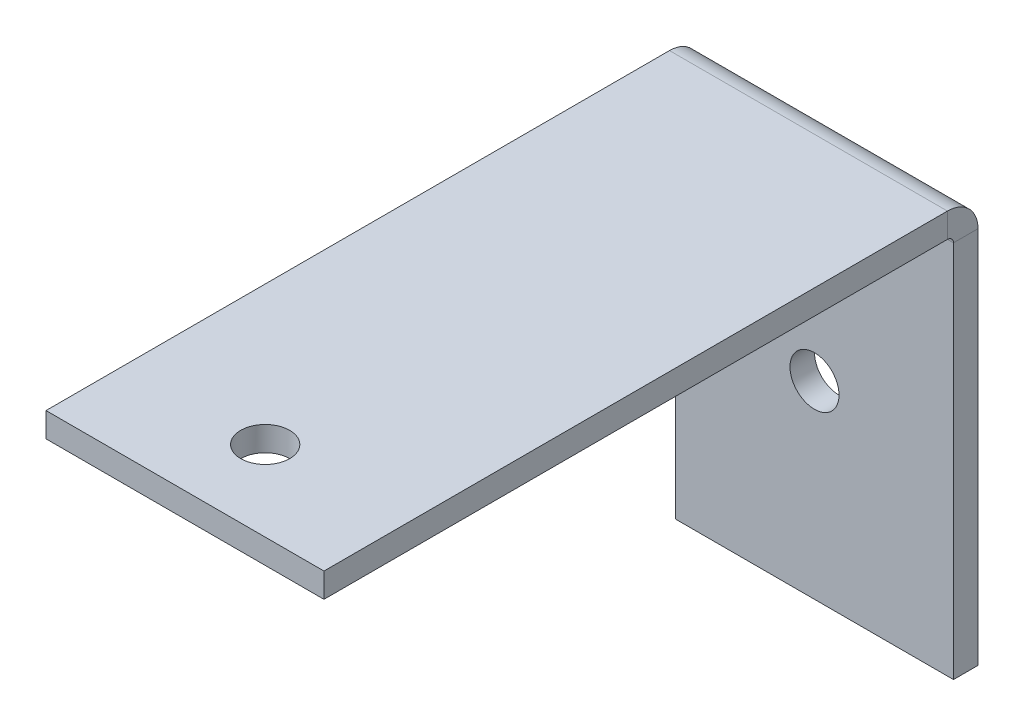
ISO-10303-21;
HEADER;
FILE_DESCRIPTION(('STEP AP214'),'2;1');
FILE_NAME('part.step','',(''),(''),'','','');
FILE_SCHEMA(('AUTOMOTIVE_DESIGN { 1 0 10303 214 1 1 1 1 }'));
ENDSEC;
DATA;
#1=APPLICATION_CONTEXT('core data for automotive mechanical design processes');
#2=APPLICATION_PROTOCOL_DEFINITION('international standard','automotive_design',2000,#1);
#3=PRODUCT_CONTEXT('',#1,'mechanical');
#4=PRODUCT('Part','Part','',(#3));
#5=PRODUCT_RELATED_PRODUCT_CATEGORY('part','',(#4));
#6=PRODUCT_DEFINITION_FORMATION('','',#4);
#7=PRODUCT_DEFINITION_CONTEXT('part definition',#1,'design');
#8=PRODUCT_DEFINITION('design','',#6,#7);
#9=PRODUCT_DEFINITION_SHAPE('','',#8);
#10=(LENGTH_UNIT() NAMED_UNIT(*) SI_UNIT(.MILLI.,.METRE.));
#11=(NAMED_UNIT(*) PLANE_ANGLE_UNIT() SI_UNIT($,.RADIAN.));
#12=(NAMED_UNIT(*) SI_UNIT($,.STERADIAN.) SOLID_ANGLE_UNIT());
#13=UNCERTAINTY_MEASURE_WITH_UNIT(LENGTH_MEASURE(1.E-05),#10,'distance_accuracy_value','');
#14=(GEOMETRIC_REPRESENTATION_CONTEXT(3) GLOBAL_UNCERTAINTY_ASSIGNED_CONTEXT((#13)) GLOBAL_UNIT_ASSIGNED_CONTEXT((#10,
#11,#12)) REPRESENTATION_CONTEXT('',''));
#15=CARTESIAN_POINT('',(0.,0.,0.));
#16=DIRECTION('',(0.,0.,1.));
#17=DIRECTION('',(1.,0.,0.));
#18=AXIS2_PLACEMENT_3D('',#15,#16,#17);
#19=CARTESIAN_POINT('',(0.,50.,3.));
#20=DIRECTION('',(0.,0.,-1.));
#21=DIRECTION('',(-1.,0.,0.));
#22=AXIS2_PLACEMENT_3D('',#19,#20,#21);
#23=PLANE('',#22);
#24=CARTESIAN_POINT('',(17.,23.1317,3.));
#25=DIRECTION('',(0.,0.,1.));
#26=DIRECTION('',(1.,0.,0.));
#27=AXIS2_PLACEMENT_3D('',#24,#25,#26);
#28=CIRCLE('',#27,3.);
#29=CARTESIAN_POINT('',(20.,23.1317,3.));
#30=VERTEX_POINT('',#29);
#31=EDGE_CURVE('E213',#30,#30,#28,.T.);
#32=ORIENTED_EDGE('',*,*,#31,.F.);
#33=EDGE_LOOP('',(#32));
#34=FACE_BOUND('',#33,.T.);
#35=DIRECTION('',(-1.,0.,0.));
#36=VECTOR('',#35,1.);
#37=CARTESIAN_POINT('',(0.,46.2634,3.00000000000001));
#38=LINE('',#37,#36);
#39=CARTESIAN_POINT('',(0.,46.2634,3.00000000000001));
#40=VERTEX_POINT('',#39);
#41=CARTESIAN_POINT('',(34.,46.2634,3.00000000000001));
#42=VERTEX_POINT('',#41);
#43=EDGE_CURVE('E182',#40,#42,#38,.F.);
#44=ORIENTED_EDGE('',*,*,#43,.F.);
#45=DIRECTION('',(0.,-1.,0.));
#46=VECTOR('',#45,1.);
#47=CARTESIAN_POINT('',(0.,50.,3.));
#48=LINE('',#47,#46);
#49=CARTESIAN_POINT('',(0.,0.,3.));
#50=VERTEX_POINT('',#49);
#51=EDGE_CURVE('E73',#40,#50,#48,.T.);
#52=ORIENTED_EDGE('',*,*,#51,.T.);
#53=DIRECTION('',(1.,0.,0.));
#54=VECTOR('',#53,1.);
#55=CARTESIAN_POINT('',(0.,0.,3.));
#56=LINE('',#55,#54);
#57=CARTESIAN_POINT('',(34.,0.,3.));
#58=VERTEX_POINT('',#57);
#59=EDGE_CURVE('E190',#50,#58,#56,.T.);
#60=ORIENTED_EDGE('',*,*,#59,.T.);
#61=DIRECTION('',(0.,-1.,0.));
#62=VECTOR('',#61,1.);
#63=CARTESIAN_POINT('',(34.,50.,3.));
#64=LINE('',#63,#62);
#65=EDGE_CURVE('E13',#42,#58,#64,.T.);
#66=ORIENTED_EDGE('',*,*,#65,.F.);
#67=EDGE_LOOP('',(#44,#52,#60,#66));
#68=FACE_BOUND('',#67,.T.);
#69=ADVANCED_FACE('F57',(#34,#68),#23,.F.);
#70=CARTESIAN_POINT('',(0.,50.,0.));
#71=DIRECTION('',(0.,0.,-1.));
#72=DIRECTION('',(-1.,0.,0.));
#73=AXIS2_PLACEMENT_3D('',#70,#71,#72);
#74=PLANE('',#73);
#75=CARTESIAN_POINT('',(17.,23.1317,0.));
#76=DIRECTION('',(0.,0.,-1.));
#77=DIRECTION('',(-1.,0.,0.));
#78=AXIS2_PLACEMENT_3D('',#75,#76,#77);
#79=CIRCLE('',#78,3.);
#80=CARTESIAN_POINT('',(14.,23.1317,0.));
#81=VERTEX_POINT('',#80);
#82=EDGE_CURVE('E60',#81,#81,#79,.T.);
#83=ORIENTED_EDGE('',*,*,#82,.F.);
#84=EDGE_LOOP('',(#83));
#85=FACE_BOUND('',#84,.T.);
#86=DIRECTION('',(0.,-1.,0.));
#87=VECTOR('',#86,1.);
#88=CARTESIAN_POINT('',(0.,50.,0.));
#89=LINE('',#88,#87);
#90=CARTESIAN_POINT('',(0.,46.2634,0.));
#91=VERTEX_POINT('',#90);
#92=CARTESIAN_POINT('',(0.,0.,0.));
#93=VERTEX_POINT('',#92);
#94=EDGE_CURVE('E81',#91,#93,#89,.T.);
#95=ORIENTED_EDGE('',*,*,#94,.F.);
#96=DIRECTION('',(-1.,0.,0.));
#97=VECTOR('',#96,1.);
#98=CARTESIAN_POINT('',(0.,46.2634,0.));
#99=LINE('',#98,#97);
#100=CARTESIAN_POINT('',(34.,46.2634,0.));
#101=VERTEX_POINT('',#100);
#102=EDGE_CURVE('E169',#91,#101,#99,.F.);
#103=ORIENTED_EDGE('',*,*,#102,.T.);
#104=DIRECTION('',(0.,-1.,0.));
#105=VECTOR('',#104,1.);
#106=CARTESIAN_POINT('',(34.,50.,0.));
#107=LINE('',#106,#105);
#108=CARTESIAN_POINT('',(34.,0.,0.));
#109=VERTEX_POINT('',#108);
#110=EDGE_CURVE('E65',#101,#109,#107,.T.);
#111=ORIENTED_EDGE('',*,*,#110,.T.);
#112=DIRECTION('',(1.,0.,0.));
#113=VECTOR('',#112,1.);
#114=CARTESIAN_POINT('',(0.,0.,0.));
#115=LINE('',#114,#113);
#116=EDGE_CURVE('E196',#93,#109,#115,.T.);
#117=ORIENTED_EDGE('',*,*,#116,.F.);
#118=EDGE_LOOP('',(#95,#103,#111,#117));
#119=FACE_BOUND('',#118,.T.);
#120=ADVANCED_FACE('F240',(#85,#119),#74,.T.);
#121=CARTESIAN_POINT('',(0.,50.,3.));
#122=DIRECTION('',(-1.,0.,0.));
#123=DIRECTION('',(0.,0.,1.));
#124=AXIS2_PLACEMENT_3D('',#121,#122,#123);
#125=PLANE('',#124);
#126=ORIENTED_EDGE('',*,*,#51,.F.);
#127=DIRECTION('',(0.,0.,-1.));
#128=VECTOR('',#127,1.);
#129=CARTESIAN_POINT('',(0.,46.2634,3.00000000000001));
#130=LINE('',#129,#128);
#131=EDGE_CURVE('E176',#40,#91,#130,.T.);
#132=ORIENTED_EDGE('',*,*,#131,.T.);
#133=ORIENTED_EDGE('',*,*,#94,.T.);
#134=DIRECTION('',(0.,0.,-1.));
#135=VECTOR('',#134,1.);
#136=CARTESIAN_POINT('',(0.,0.,3.));
#137=LINE('',#136,#135);
#138=EDGE_CURVE('E199',#50,#93,#137,.T.);
#139=ORIENTED_EDGE('',*,*,#138,.F.);
#140=EDGE_LOOP('',(#126,#132,#133,#139));
#141=FACE_BOUND('',#140,.T.);
#142=ADVANCED_FACE('F245',(#141),#125,.T.);
#143=CARTESIAN_POINT('',(34.,50.,0.));
#144=DIRECTION('',(1.,0.,0.));
#145=DIRECTION('',(0.,0.,-1.));
#146=AXIS2_PLACEMENT_3D('',#143,#144,#145);
#147=PLANE('',#146);
#148=DIRECTION('',(0.,0.,-1.));
#149=VECTOR('',#148,1.);
#150=CARTESIAN_POINT('',(34.,46.2634,3.00000000000001));
#151=LINE('',#150,#149);
#152=EDGE_CURVE('E187',#42,#101,#151,.T.);
#153=ORIENTED_EDGE('',*,*,#152,.F.);
#154=ORIENTED_EDGE('',*,*,#65,.T.);
#155=DIRECTION('',(0.,0.,1.));
#156=VECTOR('',#155,1.);
#157=CARTESIAN_POINT('',(34.,0.,0.));
#158=LINE('',#157,#156);
#159=EDGE_CURVE('E193',#109,#58,#158,.T.);
#160=ORIENTED_EDGE('',*,*,#159,.F.);
#161=ORIENTED_EDGE('',*,*,#110,.F.);
#162=EDGE_LOOP('',(#153,#154,#160,#161));
#163=FACE_BOUND('',#162,.T.);
#164=ADVANCED_FACE('F257',(#163),#147,.T.);
#165=CARTESIAN_POINT('',(0.,0.,0.));
#166=DIRECTION('',(0.,-1.,0.));
#167=DIRECTION('',(-1.,0.,0.));
#168=AXIS2_PLACEMENT_3D('',#165,#166,#167);
#169=PLANE('',#168);
#170=ORIENTED_EDGE('',*,*,#59,.F.);
#171=ORIENTED_EDGE('',*,*,#138,.T.);
#172=ORIENTED_EDGE('',*,*,#116,.T.);
#173=ORIENTED_EDGE('',*,*,#159,.T.);
#174=EDGE_LOOP('',(#170,#171,#172,#173));
#175=FACE_BOUND('',#174,.T.);
#176=ADVANCED_FACE('F252',(#175),#169,.T.);
#177=CARTESIAN_POINT('',(34.,46.2634,3.7366));
#178=DIRECTION('',(1.,0.,0.));
#179=DIRECTION('',(0.,0.,-1.));
#180=AXIS2_PLACEMENT_3D('',#177,#178,#179);
#181=PLANE('',#180);
#182=DIRECTION('',(0.,-1.,0.));
#183=VECTOR('',#182,1.);
#184=CARTESIAN_POINT('',(34.,50.,3.73659999999999));
#185=LINE('',#184,#183);
#186=CARTESIAN_POINT('',(34.,47.,3.7366));
#187=VERTEX_POINT('',#186);
#188=CARTESIAN_POINT('',(34.,50.,3.73659999999999));
#189=VERTEX_POINT('',#188);
#190=EDGE_CURVE('E150',#187,#189,#185,.F.);
#191=ORIENTED_EDGE('',*,*,#190,.F.);
#192=CARTESIAN_POINT('',(34.,46.2634,3.7366));
#193=DIRECTION('',(-1.,0.,0.));
#194=DIRECTION('',(0.,0.,1.));
#195=AXIS2_PLACEMENT_3D('',#192,#193,#194);
#196=CIRCLE('',#195,0.736599999999997);
#197=EDGE_CURVE('E179',#42,#187,#196,.F.);
#198=ORIENTED_EDGE('',*,*,#197,.F.);
#199=ORIENTED_EDGE('',*,*,#152,.T.);
#200=CARTESIAN_POINT('',(34.,46.2634,3.7366));
#201=DIRECTION('',(-1.,0.,0.));
#202=DIRECTION('',(0.,0.,1.));
#203=AXIS2_PLACEMENT_3D('',#200,#201,#202);
#204=CIRCLE('',#203,3.7366);
#205=EDGE_CURVE('E172',#101,#189,#204,.F.);
#206=ORIENTED_EDGE('',*,*,#205,.T.);
#207=EDGE_LOOP('',(#191,#198,#199,#206));
#208=FACE_BOUND('',#207,.T.);
#209=ADVANCED_FACE('F259',(#208),#181,.T.);
#210=CARTESIAN_POINT('',(0.,46.2634,3.7366));
#211=DIRECTION('',(1.,0.,0.));
#212=DIRECTION('',(0.,0.,-1.));
#213=AXIS2_PLACEMENT_3D('',#210,#211,#212);
#214=PLANE('',#213);
#215=CARTESIAN_POINT('',(0.,46.2634,3.7366));
#216=DIRECTION('',(-1.,0.,0.));
#217=DIRECTION('',(0.,0.,1.));
#218=AXIS2_PLACEMENT_3D('',#215,#216,#217);
#219=CIRCLE('',#218,0.736599999999997);
#220=CARTESIAN_POINT('',(0.,47.,3.7366));
#221=VERTEX_POINT('',#220);
#222=EDGE_CURVE('E184',#221,#40,#219,.T.);
#223=ORIENTED_EDGE('',*,*,#222,.F.);
#224=DIRECTION('',(0.,-1.,0.));
#225=VECTOR('',#224,1.);
#226=CARTESIAN_POINT('',(0.,47.,3.7366));
#227=LINE('',#226,#225);
#228=CARTESIAN_POINT('',(0.,50.,3.73659999999999));
#229=VERTEX_POINT('',#228);
#230=EDGE_CURVE('E162',#221,#229,#227,.F.);
#231=ORIENTED_EDGE('',*,*,#230,.T.);
#232=CARTESIAN_POINT('',(0.,46.2634,3.7366));
#233=DIRECTION('',(-1.,0.,0.));
#234=DIRECTION('',(0.,0.,1.));
#235=AXIS2_PLACEMENT_3D('',#232,#233,#234);
#236=CIRCLE('',#235,3.7366);
#237=EDGE_CURVE('E173',#229,#91,#236,.T.);
#238=ORIENTED_EDGE('',*,*,#237,.T.);
#239=ORIENTED_EDGE('',*,*,#131,.F.);
#240=EDGE_LOOP('',(#223,#231,#238,#239));
#241=FACE_BOUND('',#240,.T.);
#242=ADVANCED_FACE('F226',(#241),#214,.F.);
#243=CARTESIAN_POINT('',(0.,46.2634,3.7366));
#244=DIRECTION('',(-1.,0.,0.));
#245=DIRECTION('',(0.,1.,0.));
#246=AXIS2_PLACEMENT_3D('',#243,#244,#245);
#247=CYLINDRICAL_SURFACE('',#246,3.7366);
#248=ORIENTED_EDGE('',*,*,#102,.F.);
#249=ORIENTED_EDGE('',*,*,#237,.F.);
#250=DIRECTION('',(-1.,0.,0.));
#251=VECTOR('',#250,1.);
#252=CARTESIAN_POINT('',(34.,50.,3.73659999999999));
#253=LINE('',#252,#251);
#254=EDGE_CURVE('E160',#229,#189,#253,.F.);
#255=ORIENTED_EDGE('',*,*,#254,.T.);
#256=ORIENTED_EDGE('',*,*,#205,.F.);
#257=EDGE_LOOP('',(#248,#249,#255,#256));
#258=FACE_BOUND('',#257,.T.);
#259=ADVANCED_FACE('F235',(#258),#247,.T.);
#260=CARTESIAN_POINT('',(0.,46.2634,3.7366));
#261=DIRECTION('',(-1.,0.,0.));
#262=DIRECTION('',(0.,1.,0.));
#263=AXIS2_PLACEMENT_3D('',#260,#261,#262);
#264=CYLINDRICAL_SURFACE('',#263,0.736599999999997);
#265=ORIENTED_EDGE('',*,*,#43,.T.);
#266=ORIENTED_EDGE('',*,*,#197,.T.);
#267=DIRECTION('',(-1.,0.,0.));
#268=VECTOR('',#267,1.);
#269=CARTESIAN_POINT('',(34.,47.,3.7366));
#270=LINE('',#269,#268);
#271=EDGE_CURVE('E165',#187,#221,#270,.T.);
#272=ORIENTED_EDGE('',*,*,#271,.T.);
#273=ORIENTED_EDGE('',*,*,#222,.T.);
#274=EDGE_LOOP('',(#265,#266,#272,#273));
#275=FACE_BOUND('',#274,.T.);
#276=ADVANCED_FACE('F222',(#275),#264,.F.);
#277=CARTESIAN_POINT('',(0.,50.0000000000003,80.));
#278=DIRECTION('',(1.,0.,0.));
#279=DIRECTION('',(0.,0.,-1.));
#280=AXIS2_PLACEMENT_3D('',#277,#278,#279);
#281=PLANE('',#280);
#282=ORIENTED_EDGE('',*,*,#230,.F.);
#283=DIRECTION('',(0.,0.,-1.));
#284=VECTOR('',#283,1.);
#285=CARTESIAN_POINT('',(0.,47.0000000000003,80.));
#286=LINE('',#285,#284);
#287=CARTESIAN_POINT('',(0.,47.0000000000003,80.));
#288=VERTEX_POINT('',#287);
#289=EDGE_CURVE('E158',#221,#288,#286,.F.);
#290=ORIENTED_EDGE('',*,*,#289,.T.);
#291=DIRECTION('',(0.,-1.,0.));
#292=VECTOR('',#291,1.);
#293=CARTESIAN_POINT('',(0.,50.0000000000003,80.));
#294=LINE('',#293,#292);
#295=CARTESIAN_POINT('',(0.,50.0000000000003,80.));
#296=VERTEX_POINT('',#295);
#297=EDGE_CURVE('E146',#296,#288,#294,.T.);
#298=ORIENTED_EDGE('',*,*,#297,.F.);
#299=DIRECTION('',(0.,0.,1.));
#300=VECTOR('',#299,1.);
#301=CARTESIAN_POINT('',(0.,50.,-1.86199679245349E-13));
#302=LINE('',#301,#300);
#303=EDGE_CURVE('E133',#229,#296,#302,.T.);
#304=ORIENTED_EDGE('',*,*,#303,.F.);
#305=EDGE_LOOP('',(#282,#290,#298,#304));
#306=FACE_BOUND('',#305,.T.);
#307=ADVANCED_FACE('F227',(#306),#281,.F.);
#308=CARTESIAN_POINT('',(34.,50.,2.99999999999999));
#309=DIRECTION('',(-1.,0.,0.));
#310=DIRECTION('',(0.,0.,1.));
#311=AXIS2_PLACEMENT_3D('',#308,#309,#310);
#312=PLANE('',#311);
#313=ORIENTED_EDGE('',*,*,#190,.T.);
#314=DIRECTION('',(0.,0.,-1.));
#315=VECTOR('',#314,1.);
#316=CARTESIAN_POINT('',(34.,50.,-1.86199679245349E-13));
#317=LINE('',#316,#315);
#318=CARTESIAN_POINT('',(34.,50.0000000000003,80.));
#319=VERTEX_POINT('',#318);
#320=EDGE_CURVE('E131',#319,#189,#317,.T.);
#321=ORIENTED_EDGE('',*,*,#320,.F.);
#322=DIRECTION('',(0.,-1.,0.));
#323=VECTOR('',#322,1.);
#324=CARTESIAN_POINT('',(34.,50.0000000000003,80.));
#325=LINE('',#324,#323);
#326=CARTESIAN_POINT('',(34.,47.0000000000003,80.));
#327=VERTEX_POINT('',#326);
#328=EDGE_CURVE('E139',#319,#327,#325,.T.);
#329=ORIENTED_EDGE('',*,*,#328,.T.);
#330=DIRECTION('',(0.,0.,1.));
#331=VECTOR('',#330,1.);
#332=CARTESIAN_POINT('',(34.,47.,3.));
#333=LINE('',#332,#331);
#334=EDGE_CURVE('E155',#327,#187,#333,.F.);
#335=ORIENTED_EDGE('',*,*,#334,.T.);
#336=EDGE_LOOP('',(#313,#321,#329,#335));
#337=FACE_BOUND('',#336,.T.);
#338=ADVANCED_FACE('F149',(#337),#312,.F.);
#339=CARTESIAN_POINT('',(0.,50.,-1.86199679245349E-13));
#340=DIRECTION('',(0.,-1.,0.));
#341=DIRECTION('',(0.,0.,-1.));
#342=AXIS2_PLACEMENT_3D('',#339,#340,#341);
#343=PLANE('',#342);
#344=CARTESIAN_POINT('',(17.,50.0000000000002,70.19));
#345=DIRECTION('',(0.,1.,0.));
#346=DIRECTION('',(0.,0.,1.));
#347=AXIS2_PLACEMENT_3D('',#344,#345,#346);
#348=CIRCLE('',#347,3.);
#349=CARTESIAN_POINT('',(17.,50.0000000000003,73.19));
#350=VERTEX_POINT('',#349);
#351=EDGE_CURVE('E205',#350,#350,#348,.T.);
#352=ORIENTED_EDGE('',*,*,#351,.F.);
#353=EDGE_LOOP('',(#352));
#354=FACE_BOUND('',#353,.T.);
#355=ORIENTED_EDGE('',*,*,#254,.F.);
#356=ORIENTED_EDGE('',*,*,#303,.T.);
#357=DIRECTION('',(1.,0.,0.));
#358=VECTOR('',#357,1.);
#359=CARTESIAN_POINT('',(0.,50.0000000000003,80.));
#360=LINE('',#359,#358);
#361=EDGE_CURVE('E126',#296,#319,#360,.T.);
#362=ORIENTED_EDGE('',*,*,#361,.T.);
#363=ORIENTED_EDGE('',*,*,#320,.T.);
#364=EDGE_LOOP('',(#355,#356,#362,#363));
#365=FACE_BOUND('',#364,.T.);
#366=ADVANCED_FACE('F129',(#354,#365),#343,.F.);
#367=CARTESIAN_POINT('',(0.,47.,-1.75725235228819E-13));
#368=DIRECTION('',(0.,-1.,0.));
#369=DIRECTION('',(0.,0.,-1.));
#370=AXIS2_PLACEMENT_3D('',#367,#368,#369);
#371=PLANE('',#370);
#372=CARTESIAN_POINT('',(17.,47.0000000000002,70.19));
#373=DIRECTION('',(0.,-1.,0.));
#374=DIRECTION('',(0.,0.,-1.));
#375=AXIS2_PLACEMENT_3D('',#372,#373,#374);
#376=CIRCLE('',#375,3.);
#377=CARTESIAN_POINT('',(17.,47.0000000000002,67.19));
#378=VERTEX_POINT('',#377);
#379=EDGE_CURVE('E168',#378,#378,#376,.T.);
#380=ORIENTED_EDGE('',*,*,#379,.F.);
#381=EDGE_LOOP('',(#380));
#382=FACE_BOUND('',#381,.T.);
#383=ORIENTED_EDGE('',*,*,#289,.F.);
#384=ORIENTED_EDGE('',*,*,#271,.F.);
#385=ORIENTED_EDGE('',*,*,#334,.F.);
#386=DIRECTION('',(-1.,0.,0.));
#387=VECTOR('',#386,1.);
#388=CARTESIAN_POINT('',(34.,47.0000000000003,80.));
#389=LINE('',#388,#387);
#390=EDGE_CURVE('E142',#288,#327,#389,.F.);
#391=ORIENTED_EDGE('',*,*,#390,.F.);
#392=EDGE_LOOP('',(#383,#384,#385,#391));
#393=FACE_BOUND('',#392,.T.);
#394=ADVANCED_FACE('F218',(#382,#393),#371,.T.);
#395=CARTESIAN_POINT('',(34.,50.0000000000003,80.));
#396=DIRECTION('',(0.,0.,-1.));
#397=DIRECTION('',(0.,1.,0.));
#398=AXIS2_PLACEMENT_3D('',#395,#396,#397);
#399=PLANE('',#398);
#400=ORIENTED_EDGE('',*,*,#390,.T.);
#401=ORIENTED_EDGE('',*,*,#328,.F.);
#402=ORIENTED_EDGE('',*,*,#361,.F.);
#403=ORIENTED_EDGE('',*,*,#297,.T.);
#404=EDGE_LOOP('',(#400,#401,#402,#403));
#405=FACE_BOUND('',#404,.T.);
#406=ADVANCED_FACE('F140',(#405),#399,.F.);
#407=CARTESIAN_POINT('',(17.,40.0000000000002,70.19));
#408=DIRECTION('',(0.,1.,0.));
#409=DIRECTION('',(0.,0.,1.));
#410=AXIS2_PLACEMENT_3D('',#407,#408,#409);
#411=CYLINDRICAL_SURFACE('',#410,3.);
#412=ORIENTED_EDGE('',*,*,#379,.T.);
#413=EDGE_LOOP('',(#412));
#414=FACE_BOUND('',#413,.T.);
#415=ORIENTED_EDGE('',*,*,#351,.T.);
#416=EDGE_LOOP('',(#415));
#417=FACE_BOUND('',#416,.T.);
#418=ADVANCED_FACE('F326',(#414,#417),#411,.F.);
#419=CARTESIAN_POINT('',(17.,23.1317,-7.));
#420=DIRECTION('',(0.,0.,1.));
#421=DIRECTION('',(1.,0.,0.));
#422=AXIS2_PLACEMENT_3D('',#419,#420,#421);
#423=CYLINDRICAL_SURFACE('',#422,3.);
#424=ORIENTED_EDGE('',*,*,#82,.T.);
#425=EDGE_LOOP('',(#424));
#426=FACE_BOUND('',#425,.T.);
#427=ORIENTED_EDGE('',*,*,#31,.T.);
#428=EDGE_LOOP('',(#427));
#429=FACE_BOUND('',#428,.T.);
#430=ADVANCED_FACE('F352',(#426,#429),#423,.F.);
#431=CLOSED_SHELL('',(#69,#120,#142,#164,#176,#209,#242,#259,#276,#307,#338,#366,#394,#406,#418,#430));
#432=MANIFOLD_SOLID_BREP('B2',#431);
#433=ADVANCED_BREP_SHAPE_REPRESENTATION('',(#18,#432),#14);
#434=SHAPE_DEFINITION_REPRESENTATION(#9,#433);
ENDSEC;
END-ISO-10303-21;
